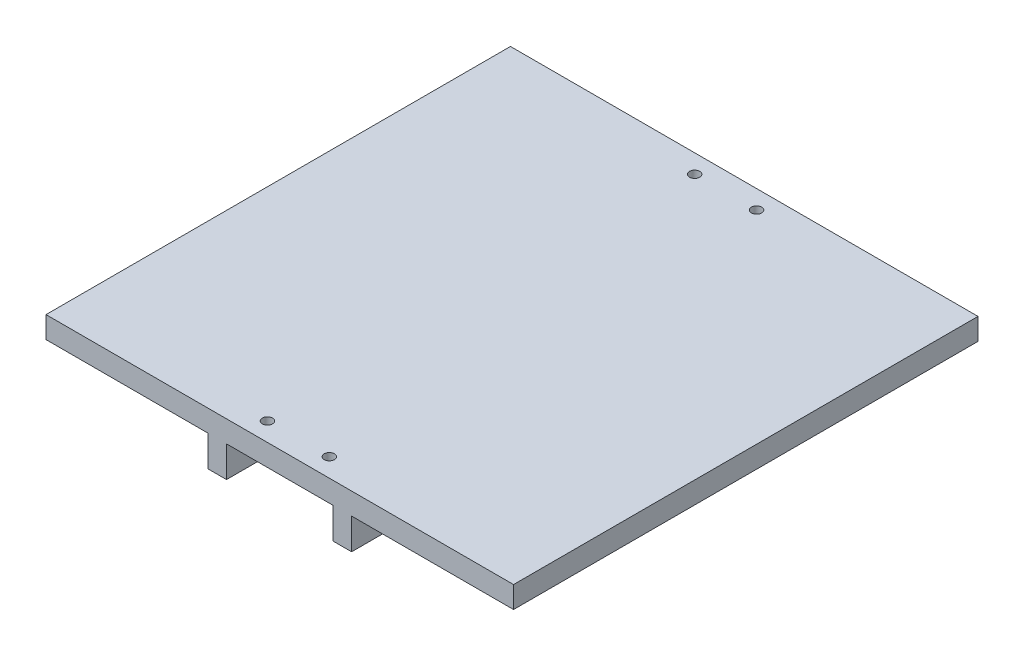
ISO-10303-21;
HEADER;
FILE_DESCRIPTION(('STEP AP214'),'2;1');
FILE_NAME('part.step','',(''),(''),'','','');
FILE_SCHEMA(('AUTOMOTIVE_DESIGN { 1 0 10303 214 1 1 1 1 }'));
ENDSEC;
DATA;
#1=APPLICATION_CONTEXT('core data for automotive mechanical design processes');
#2=APPLICATION_PROTOCOL_DEFINITION('international standard','automotive_design',2000,#1);
#3=PRODUCT_CONTEXT('',#1,'mechanical');
#4=PRODUCT('Part','Part','',(#3));
#5=PRODUCT_RELATED_PRODUCT_CATEGORY('part','',(#4));
#6=PRODUCT_DEFINITION_FORMATION('','',#4);
#7=PRODUCT_DEFINITION_CONTEXT('part definition',#1,'design');
#8=PRODUCT_DEFINITION('design','',#6,#7);
#9=PRODUCT_DEFINITION_SHAPE('','',#8);
#10=(LENGTH_UNIT() NAMED_UNIT(*) SI_UNIT(.MILLI.,.METRE.));
#11=(NAMED_UNIT(*) PLANE_ANGLE_UNIT() SI_UNIT($,.RADIAN.));
#12=(NAMED_UNIT(*) SI_UNIT($,.STERADIAN.) SOLID_ANGLE_UNIT());
#13=UNCERTAINTY_MEASURE_WITH_UNIT(LENGTH_MEASURE(1.E-05),#10,'distance_accuracy_value','');
#14=(GEOMETRIC_REPRESENTATION_CONTEXT(3) GLOBAL_UNCERTAINTY_ASSIGNED_CONTEXT((#13)) GLOBAL_UNIT_ASSIGNED_CONTEXT((#10,
#11,#12)) REPRESENTATION_CONTEXT('',''));
#15=CARTESIAN_POINT('',(0.,0.,0.));
#16=DIRECTION('',(0.,0.,1.));
#17=DIRECTION('',(1.,0.,0.));
#18=AXIS2_PLACEMENT_3D('',#15,#16,#17);
#19=CARTESIAN_POINT('',(23.2,-3.49999999999996,150.));
#20=DIRECTION('',(0.,1.,0.));
#21=DIRECTION('',(-1.,0.,0.));
#22=AXIS2_PLACEMENT_3D('',#19,#20,#21);
#23=PLANE('',#22);
#24=DIRECTION('',(1.,0.,0.));
#25=VECTOR('',#24,1.);
#26=CARTESIAN_POINT('',(23.2,-3.49999999999996,0.));
#27=LINE('',#26,#25);
#28=CARTESIAN_POINT('',(23.2,-3.49999999999996,0.));
#29=VERTEX_POINT('',#28);
#30=CARTESIAN_POINT('',(75.5,-3.5,0.));
#31=VERTEX_POINT('',#30);
#32=EDGE_CURVE('E163',#29,#31,#27,.T.);
#33=ORIENTED_EDGE('',*,*,#32,.T.);
#34=DIRECTION('',(0.,0.,-1.));
#35=VECTOR('',#34,1.);
#36=CARTESIAN_POINT('',(75.5,-3.5,150.));
#37=LINE('',#36,#35);
#38=CARTESIAN_POINT('',(75.5,-3.5,150.));
#39=VERTEX_POINT('',#38);
#40=EDGE_CURVE('E11',#39,#31,#37,.T.);
#41=ORIENTED_EDGE('',*,*,#40,.F.);
#42=DIRECTION('',(1.,0.,0.));
#43=VECTOR('',#42,1.);
#44=CARTESIAN_POINT('',(23.2,-3.49999999999996,150.));
#45=LINE('',#44,#43);
#46=CARTESIAN_POINT('',(23.2,-3.49999999999996,150.));
#47=VERTEX_POINT('',#46);
#48=EDGE_CURVE('E198',#47,#39,#45,.T.);
#49=ORIENTED_EDGE('',*,*,#48,.F.);
#50=DIRECTION('',(0.,0.,-1.));
#51=VECTOR('',#50,1.);
#52=CARTESIAN_POINT('',(23.2,-3.49999999999996,150.));
#53=LINE('',#52,#51);
#54=EDGE_CURVE('E159',#47,#29,#53,.T.);
#55=ORIENTED_EDGE('',*,*,#54,.T.);
#56=EDGE_LOOP('',(#33,#41,#49,#55));
#57=FACE_BOUND('',#56,.T.);
#58=ADVANCED_FACE('F38',(#57),#23,.F.);
#59=CARTESIAN_POINT('',(75.5,3.5,150.));
#60=DIRECTION('',(-1.,0.,0.));
#61=DIRECTION('',(0.,0.,1.));
#62=AXIS2_PLACEMENT_3D('',#59,#60,#61);
#63=PLANE('',#62);
#64=DIRECTION('',(0.,1.,0.));
#65=VECTOR('',#64,1.);
#66=CARTESIAN_POINT('',(75.5,3.5,0.));
#67=LINE('',#66,#65);
#68=CARTESIAN_POINT('',(75.5,3.5,0.));
#69=VERTEX_POINT('',#68);
#70=EDGE_CURVE('E167',#31,#69,#67,.T.);
#71=ORIENTED_EDGE('',*,*,#70,.T.);
#72=DIRECTION('',(0.,0.,-1.));
#73=VECTOR('',#72,1.);
#74=CARTESIAN_POINT('',(75.5,3.5,150.));
#75=LINE('',#74,#73);
#76=CARTESIAN_POINT('',(75.5,3.5,150.));
#77=VERTEX_POINT('',#76);
#78=EDGE_CURVE('E47',#77,#69,#75,.T.);
#79=ORIENTED_EDGE('',*,*,#78,.F.);
#80=DIRECTION('',(0.,1.,0.));
#81=VECTOR('',#80,1.);
#82=CARTESIAN_POINT('',(75.5,3.5,150.));
#83=LINE('',#82,#81);
#84=EDGE_CURVE('E110',#39,#77,#83,.T.);
#85=ORIENTED_EDGE('',*,*,#84,.F.);
#86=ORIENTED_EDGE('',*,*,#40,.T.);
#87=EDGE_LOOP('',(#71,#79,#85,#86));
#88=FACE_BOUND('',#87,.T.);
#89=ADVANCED_FACE('F292',(#88),#63,.F.);
#90=CARTESIAN_POINT('',(-75.5,3.5,150.));
#91=DIRECTION('',(0.,-1.,0.));
#92=DIRECTION('',(0.,0.,-1.));
#93=AXIS2_PLACEMENT_3D('',#90,#91,#92);
#94=PLANE('',#93);
#95=CARTESIAN_POINT('',(9.99999999999998,3.5,6.));
#96=DIRECTION('',(0.,-1.,0.));
#97=DIRECTION('',(0.,0.,-1.));
#98=AXIS2_PLACEMENT_3D('',#95,#96,#97);
#99=CIRCLE('',#98,1.65);
#100=CARTESIAN_POINT('',(9.99999999999998,3.5,4.35));
#101=VERTEX_POINT('',#100);
#102=EDGE_CURVE('E399',#101,#101,#99,.F.);
#103=ORIENTED_EDGE('',*,*,#102,.F.);
#104=EDGE_LOOP('',(#103));
#105=FACE_BOUND('',#104,.T.);
#106=CARTESIAN_POINT('',(-10.,3.5,144.));
#107=DIRECTION('',(0.,-1.,0.));
#108=DIRECTION('',(0.,0.,-1.));
#109=AXIS2_PLACEMENT_3D('',#106,#107,#108);
#110=CIRCLE('',#109,1.65);
#111=CARTESIAN_POINT('',(-10.,3.5,142.35));
#112=VERTEX_POINT('',#111);
#113=EDGE_CURVE('E404',#112,#112,#110,.F.);
#114=ORIENTED_EDGE('',*,*,#113,.F.);
#115=EDGE_LOOP('',(#114));
#116=FACE_BOUND('',#115,.T.);
#117=CARTESIAN_POINT('',(10.,3.5,144.));
#118=DIRECTION('',(0.,-1.,0.));
#119=DIRECTION('',(0.,0.,-1.));
#120=AXIS2_PLACEMENT_3D('',#117,#118,#119);
#121=CIRCLE('',#120,1.65);
#122=CARTESIAN_POINT('',(10.,3.5,142.35));
#123=VERTEX_POINT('',#122);
#124=EDGE_CURVE('E414',#123,#123,#121,.F.);
#125=ORIENTED_EDGE('',*,*,#124,.F.);
#126=EDGE_LOOP('',(#125));
#127=FACE_BOUND('',#126,.T.);
#128=CARTESIAN_POINT('',(-9.99999999999998,3.5,6.));
#129=DIRECTION('',(0.,-1.,0.));
#130=DIRECTION('',(0.,0.,-1.));
#131=AXIS2_PLACEMENT_3D('',#128,#129,#130);
#132=CIRCLE('',#131,1.65);
#133=CARTESIAN_POINT('',(-9.99999999999998,3.5,4.35));
#134=VERTEX_POINT('',#133);
#135=EDGE_CURVE('E168',#134,#134,#132,.F.);
#136=ORIENTED_EDGE('',*,*,#135,.F.);
#137=EDGE_LOOP('',(#136));
#138=FACE_BOUND('',#137,.T.);
#139=DIRECTION('',(-1.,0.,0.));
#140=VECTOR('',#139,1.);
#141=CARTESIAN_POINT('',(-75.5,3.5,0.));
#142=LINE('',#141,#140);
#143=CARTESIAN_POINT('',(-75.5,3.5,0.));
#144=VERTEX_POINT('',#143);
#145=EDGE_CURVE('E171',#69,#144,#142,.T.);
#146=ORIENTED_EDGE('',*,*,#145,.T.);
#147=DIRECTION('',(0.,0.,-1.));
#148=VECTOR('',#147,1.);
#149=CARTESIAN_POINT('',(-75.5,3.5,150.));
#150=LINE('',#149,#148);
#151=CARTESIAN_POINT('',(-75.5,3.5,150.));
#152=VERTEX_POINT('',#151);
#153=EDGE_CURVE('E225',#152,#144,#150,.T.);
#154=ORIENTED_EDGE('',*,*,#153,.F.);
#155=DIRECTION('',(-1.,0.,0.));
#156=VECTOR('',#155,1.);
#157=CARTESIAN_POINT('',(-75.5,3.5,150.));
#158=LINE('',#157,#156);
#159=EDGE_CURVE('E235',#77,#152,#158,.T.);
#160=ORIENTED_EDGE('',*,*,#159,.F.);
#161=ORIENTED_EDGE('',*,*,#78,.T.);
#162=EDGE_LOOP('',(#146,#154,#160,#161));
#163=FACE_BOUND('',#162,.T.);
#164=ADVANCED_FACE('F233',(#105,#116,#127,#138,#163),#94,.F.);
#165=CARTESIAN_POINT('',(-75.5,3.5,150.));
#166=DIRECTION('',(1.,0.,0.));
#167=DIRECTION('',(0.,0.,-1.));
#168=AXIS2_PLACEMENT_3D('',#165,#166,#167);
#169=PLANE('',#168);
#170=DIRECTION('',(0.,-1.,0.));
#171=VECTOR('',#170,1.);
#172=CARTESIAN_POINT('',(-75.5,3.5,0.));
#173=LINE('',#172,#171);
#174=CARTESIAN_POINT('',(-75.5,-3.5,0.));
#175=VERTEX_POINT('',#174);
#176=EDGE_CURVE('E174',#144,#175,#173,.T.);
#177=ORIENTED_EDGE('',*,*,#176,.T.);
#178=DIRECTION('',(0.,0.,-1.));
#179=VECTOR('',#178,1.);
#180=CARTESIAN_POINT('',(-75.5,-3.5,150.));
#181=LINE('',#180,#179);
#182=CARTESIAN_POINT('',(-75.5,-3.5,150.));
#183=VERTEX_POINT('',#182);
#184=EDGE_CURVE('E221',#183,#175,#181,.T.);
#185=ORIENTED_EDGE('',*,*,#184,.F.);
#186=DIRECTION('',(0.,-1.,0.));
#187=VECTOR('',#186,1.);
#188=CARTESIAN_POINT('',(-75.5,3.5,150.));
#189=LINE('',#188,#187);
#190=EDGE_CURVE('E254',#152,#183,#189,.T.);
#191=ORIENTED_EDGE('',*,*,#190,.F.);
#192=ORIENTED_EDGE('',*,*,#153,.T.);
#193=EDGE_LOOP('',(#177,#185,#191,#192));
#194=FACE_BOUND('',#193,.T.);
#195=ADVANCED_FACE('F244',(#194),#169,.F.);
#196=CARTESIAN_POINT('',(-75.5,-3.5,150.));
#197=DIRECTION('',(0.,1.,0.));
#198=DIRECTION('',(-1.,0.,0.));
#199=AXIS2_PLACEMENT_3D('',#196,#197,#198);
#200=PLANE('',#199);
#201=DIRECTION('',(1.,0.,0.));
#202=VECTOR('',#201,1.);
#203=CARTESIAN_POINT('',(-75.5,-3.5,0.));
#204=LINE('',#203,#202);
#205=CARTESIAN_POINT('',(-23.2,-3.49999999999996,0.));
#206=VERTEX_POINT('',#205);
#207=EDGE_CURVE('E177',#175,#206,#204,.T.);
#208=ORIENTED_EDGE('',*,*,#207,.T.);
#209=DIRECTION('',(0.,0.,-1.));
#210=VECTOR('',#209,1.);
#211=CARTESIAN_POINT('',(-23.2,-3.49999999999996,150.));
#212=LINE('',#211,#210);
#213=CARTESIAN_POINT('',(-23.2,-3.49999999999996,150.));
#214=VERTEX_POINT('',#213);
#215=EDGE_CURVE('E217',#214,#206,#212,.T.);
#216=ORIENTED_EDGE('',*,*,#215,.F.);
#217=DIRECTION('',(1.,0.,0.));
#218=VECTOR('',#217,1.);
#219=CARTESIAN_POINT('',(-75.5,-3.5,150.));
#220=LINE('',#219,#218);
#221=EDGE_CURVE('E250',#183,#214,#220,.T.);
#222=ORIENTED_EDGE('',*,*,#221,.F.);
#223=ORIENTED_EDGE('',*,*,#184,.T.);
#224=EDGE_LOOP('',(#208,#216,#222,#223));
#225=FACE_BOUND('',#224,.T.);
#226=ADVANCED_FACE('F248',(#225),#200,.F.);
#227=CARTESIAN_POINT('',(-23.2,-13.5,150.));
#228=DIRECTION('',(1.,0.,0.));
#229=DIRECTION('',(0.,1.,0.));
#230=AXIS2_PLACEMENT_3D('',#227,#228,#229);
#231=PLANE('',#230);
#232=DIRECTION('',(0.,-1.,0.));
#233=VECTOR('',#232,1.);
#234=CARTESIAN_POINT('',(-23.2,-13.5,0.));
#235=LINE('',#234,#233);
#236=CARTESIAN_POINT('',(-23.2,-13.5,0.));
#237=VERTEX_POINT('',#236);
#238=EDGE_CURVE('E180',#206,#237,#235,.T.);
#239=ORIENTED_EDGE('',*,*,#238,.T.);
#240=DIRECTION('',(0.,0.,-1.));
#241=VECTOR('',#240,1.);
#242=CARTESIAN_POINT('',(-23.2,-13.5,150.));
#243=LINE('',#242,#241);
#244=CARTESIAN_POINT('',(-23.2,-13.5,150.));
#245=VERTEX_POINT('',#244);
#246=EDGE_CURVE('E213',#245,#237,#243,.T.);
#247=ORIENTED_EDGE('',*,*,#246,.F.);
#248=DIRECTION('',(0.,-1.,0.));
#249=VECTOR('',#248,1.);
#250=CARTESIAN_POINT('',(-23.2,-13.5,150.));
#251=LINE('',#250,#249);
#252=EDGE_CURVE('E253',#214,#245,#251,.T.);
#253=ORIENTED_EDGE('',*,*,#252,.F.);
#254=ORIENTED_EDGE('',*,*,#215,.T.);
#255=EDGE_LOOP('',(#239,#247,#253,#254));
#256=FACE_BOUND('',#255,.T.);
#257=ADVANCED_FACE('F307',(#256),#231,.F.);
#258=CARTESIAN_POINT('',(-17.2,-13.5,150.));
#259=DIRECTION('',(0.,1.,0.));
#260=DIRECTION('',(-1.,0.,0.));
#261=AXIS2_PLACEMENT_3D('',#258,#259,#260);
#262=PLANE('',#261);
#263=DIRECTION('',(1.,0.,0.));
#264=VECTOR('',#263,1.);
#265=CARTESIAN_POINT('',(-17.2,-13.5,0.));
#266=LINE('',#265,#264);
#267=CARTESIAN_POINT('',(-17.2,-13.5,0.));
#268=VERTEX_POINT('',#267);
#269=EDGE_CURVE('E183',#237,#268,#266,.T.);
#270=ORIENTED_EDGE('',*,*,#269,.T.);
#271=DIRECTION('',(0.,0.,-1.));
#272=VECTOR('',#271,1.);
#273=CARTESIAN_POINT('',(-17.2,-13.5,150.));
#274=LINE('',#273,#272);
#275=CARTESIAN_POINT('',(-17.2,-13.5,150.));
#276=VERTEX_POINT('',#275);
#277=EDGE_CURVE('E209',#276,#268,#274,.T.);
#278=ORIENTED_EDGE('',*,*,#277,.F.);
#279=DIRECTION('',(1.,0.,0.));
#280=VECTOR('',#279,1.);
#281=CARTESIAN_POINT('',(-17.2,-13.5,150.));
#282=LINE('',#281,#280);
#283=EDGE_CURVE('E258',#245,#276,#282,.T.);
#284=ORIENTED_EDGE('',*,*,#283,.F.);
#285=ORIENTED_EDGE('',*,*,#246,.T.);
#286=EDGE_LOOP('',(#270,#278,#284,#285));
#287=FACE_BOUND('',#286,.T.);
#288=ADVANCED_FACE('F310',(#287),#262,.F.);
#289=CARTESIAN_POINT('',(-17.2,-3.49999999999996,150.));
#290=DIRECTION('',(-1.,0.,0.));
#291=DIRECTION('',(0.,-1.,0.));
#292=AXIS2_PLACEMENT_3D('',#289,#290,#291);
#293=PLANE('',#292);
#294=DIRECTION('',(0.,1.,0.));
#295=VECTOR('',#294,1.);
#296=CARTESIAN_POINT('',(-17.2,-3.49999999999996,0.));
#297=LINE('',#296,#295);
#298=CARTESIAN_POINT('',(-17.2,-3.49999999999996,0.));
#299=VERTEX_POINT('',#298);
#300=EDGE_CURVE('E186',#268,#299,#297,.T.);
#301=ORIENTED_EDGE('',*,*,#300,.T.);
#302=DIRECTION('',(0.,0.,-1.));
#303=VECTOR('',#302,1.);
#304=CARTESIAN_POINT('',(-17.2,-3.49999999999996,150.));
#305=LINE('',#304,#303);
#306=CARTESIAN_POINT('',(-17.2,-3.49999999999996,150.));
#307=VERTEX_POINT('',#306);
#308=EDGE_CURVE('E205',#307,#299,#305,.T.);
#309=ORIENTED_EDGE('',*,*,#308,.F.);
#310=DIRECTION('',(0.,1.,0.));
#311=VECTOR('',#310,1.);
#312=CARTESIAN_POINT('',(-17.2,-3.49999999999996,150.));
#313=LINE('',#312,#311);
#314=EDGE_CURVE('E265',#276,#307,#313,.T.);
#315=ORIENTED_EDGE('',*,*,#314,.F.);
#316=ORIENTED_EDGE('',*,*,#277,.T.);
#317=EDGE_LOOP('',(#301,#309,#315,#316));
#318=FACE_BOUND('',#317,.T.);
#319=ADVANCED_FACE('F273',(#318),#293,.F.);
#320=CARTESIAN_POINT('',(-17.2,-3.49999999999996,150.));
#321=DIRECTION('',(0.,1.,0.));
#322=DIRECTION('',(0.,0.,1.));
#323=AXIS2_PLACEMENT_3D('',#320,#321,#322);
#324=PLANE('',#323);
#325=CARTESIAN_POINT('',(9.99999999999998,-3.49999999999996,6.));
#326=DIRECTION('',(0.,-1.,0.));
#327=DIRECTION('',(0.,0.,1.));
#328=AXIS2_PLACEMENT_3D('',#325,#326,#327);
#329=CIRCLE('',#328,1.65);
#330=CARTESIAN_POINT('',(9.99999999999998,-3.49999999999996,7.65));
#331=VERTEX_POINT('',#330);
#332=EDGE_CURVE('E402',#331,#331,#329,.T.);
#333=ORIENTED_EDGE('',*,*,#332,.F.);
#334=EDGE_LOOP('',(#333));
#335=FACE_BOUND('',#334,.T.);
#336=CARTESIAN_POINT('',(-10.,-3.49999999999996,144.));
#337=DIRECTION('',(0.,-1.,0.));
#338=DIRECTION('',(0.,0.,-1.));
#339=AXIS2_PLACEMENT_3D('',#336,#337,#338);
#340=CIRCLE('',#339,1.65);
#341=CARTESIAN_POINT('',(-10.,-3.49999999999996,142.35));
#342=VERTEX_POINT('',#341);
#343=EDGE_CURVE('E411',#342,#342,#340,.T.);
#344=ORIENTED_EDGE('',*,*,#343,.F.);
#345=EDGE_LOOP('',(#344));
#346=FACE_BOUND('',#345,.T.);
#347=CARTESIAN_POINT('',(10.,-3.49999999999996,144.));
#348=DIRECTION('',(0.,-1.,0.));
#349=DIRECTION('',(0.,0.,1.));
#350=AXIS2_PLACEMENT_3D('',#347,#348,#349);
#351=CIRCLE('',#350,1.65);
#352=CARTESIAN_POINT('',(10.,-3.49999999999996,145.65));
#353=VERTEX_POINT('',#352);
#354=EDGE_CURVE('E439',#353,#353,#351,.T.);
#355=ORIENTED_EDGE('',*,*,#354,.F.);
#356=EDGE_LOOP('',(#355));
#357=FACE_BOUND('',#356,.T.);
#358=CARTESIAN_POINT('',(-9.99999999999998,-3.49999999999996,6.));
#359=DIRECTION('',(0.,-1.,0.));
#360=DIRECTION('',(0.,0.,-1.));
#361=AXIS2_PLACEMENT_3D('',#358,#359,#360);
#362=CIRCLE('',#361,1.65);
#363=CARTESIAN_POINT('',(-9.99999999999998,-3.49999999999996,4.35));
#364=VERTEX_POINT('',#363);
#365=EDGE_CURVE('E408',#364,#364,#362,.T.);
#366=ORIENTED_EDGE('',*,*,#365,.F.);
#367=EDGE_LOOP('',(#366));
#368=FACE_BOUND('',#367,.T.);
#369=DIRECTION('',(1.,0.,0.));
#370=VECTOR('',#369,1.);
#371=CARTESIAN_POINT('',(-17.2,-3.49999999999996,0.));
#372=LINE('',#371,#370);
#373=CARTESIAN_POINT('',(17.2,-3.49999999999996,0.));
#374=VERTEX_POINT('',#373);
#375=EDGE_CURVE('E189',#299,#374,#372,.T.);
#376=ORIENTED_EDGE('',*,*,#375,.T.);
#377=DIRECTION('',(0.,0.,-1.));
#378=VECTOR('',#377,1.);
#379=CARTESIAN_POINT('',(17.2,-3.49999999999996,150.));
#380=LINE('',#379,#378);
#381=CARTESIAN_POINT('',(17.2,-3.49999999999996,150.));
#382=VERTEX_POINT('',#381);
#383=EDGE_CURVE('E152',#382,#374,#380,.T.);
#384=ORIENTED_EDGE('',*,*,#383,.F.);
#385=DIRECTION('',(1.,0.,0.));
#386=VECTOR('',#385,1.);
#387=CARTESIAN_POINT('',(-17.2,-3.49999999999996,150.));
#388=LINE('',#387,#386);
#389=EDGE_CURVE('E141',#307,#382,#388,.T.);
#390=ORIENTED_EDGE('',*,*,#389,.F.);
#391=ORIENTED_EDGE('',*,*,#308,.T.);
#392=EDGE_LOOP('',(#376,#384,#390,#391));
#393=FACE_BOUND('',#392,.T.);
#394=ADVANCED_FACE('F277',(#335,#346,#357,#368,#393),#324,.F.);
#395=CARTESIAN_POINT('',(17.2,-3.49999999999996,150.));
#396=DIRECTION('',(1.,0.,0.));
#397=DIRECTION('',(0.,0.,-1.));
#398=AXIS2_PLACEMENT_3D('',#395,#396,#397);
#399=PLANE('',#398);
#400=DIRECTION('',(0.,-1.,0.));
#401=VECTOR('',#400,1.);
#402=CARTESIAN_POINT('',(17.2,-3.49999999999996,0.));
#403=LINE('',#402,#401);
#404=CARTESIAN_POINT('',(17.2,-13.5,0.));
#405=VERTEX_POINT('',#404);
#406=EDGE_CURVE('E150',#374,#405,#403,.T.);
#407=ORIENTED_EDGE('',*,*,#406,.T.);
#408=DIRECTION('',(0.,0.,-1.));
#409=VECTOR('',#408,1.);
#410=CARTESIAN_POINT('',(17.2,-13.5,150.));
#411=LINE('',#410,#409);
#412=CARTESIAN_POINT('',(17.2,-13.5,150.));
#413=VERTEX_POINT('',#412);
#414=EDGE_CURVE('E147',#413,#405,#411,.T.);
#415=ORIENTED_EDGE('',*,*,#414,.F.);
#416=DIRECTION('',(0.,-1.,0.));
#417=VECTOR('',#416,1.);
#418=CARTESIAN_POINT('',(17.2,-3.49999999999996,150.));
#419=LINE('',#418,#417);
#420=EDGE_CURVE('E135',#382,#413,#419,.T.);
#421=ORIENTED_EDGE('',*,*,#420,.F.);
#422=ORIENTED_EDGE('',*,*,#383,.T.);
#423=EDGE_LOOP('',(#407,#415,#421,#422));
#424=FACE_BOUND('',#423,.T.);
#425=ADVANCED_FACE('F148',(#424),#399,.F.);
#426=CARTESIAN_POINT('',(17.2,-13.5,150.));
#427=DIRECTION('',(0.,1.,0.));
#428=DIRECTION('',(0.,0.,1.));
#429=AXIS2_PLACEMENT_3D('',#426,#427,#428);
#430=PLANE('',#429);
#431=DIRECTION('',(1.,0.,0.));
#432=VECTOR('',#431,1.);
#433=CARTESIAN_POINT('',(17.2,-13.5,0.));
#434=LINE('',#433,#432);
#435=CARTESIAN_POINT('',(23.2,-13.5,0.));
#436=VERTEX_POINT('',#435);
#437=EDGE_CURVE('E96',#405,#436,#434,.T.);
#438=ORIENTED_EDGE('',*,*,#437,.T.);
#439=DIRECTION('',(0.,0.,-1.));
#440=VECTOR('',#439,1.);
#441=CARTESIAN_POINT('',(23.2,-13.5,150.));
#442=LINE('',#441,#440);
#443=CARTESIAN_POINT('',(23.2,-13.5,150.));
#444=VERTEX_POINT('',#443);
#445=EDGE_CURVE('E153',#444,#436,#442,.T.);
#446=ORIENTED_EDGE('',*,*,#445,.F.);
#447=DIRECTION('',(1.,0.,0.));
#448=VECTOR('',#447,1.);
#449=CARTESIAN_POINT('',(17.2,-13.5,150.));
#450=LINE('',#449,#448);
#451=EDGE_CURVE('E139',#413,#444,#450,.T.);
#452=ORIENTED_EDGE('',*,*,#451,.F.);
#453=ORIENTED_EDGE('',*,*,#414,.T.);
#454=EDGE_LOOP('',(#438,#446,#452,#453));
#455=FACE_BOUND('',#454,.T.);
#456=ADVANCED_FACE('F155',(#455),#430,.F.);
#457=CARTESIAN_POINT('',(23.2,-13.5,150.));
#458=DIRECTION('',(-1.,0.,0.));
#459=DIRECTION('',(0.,0.,1.));
#460=AXIS2_PLACEMENT_3D('',#457,#458,#459);
#461=PLANE('',#460);
#462=DIRECTION('',(0.,1.,0.));
#463=VECTOR('',#462,1.);
#464=CARTESIAN_POINT('',(23.2,-13.5,0.));
#465=LINE('',#464,#463);
#466=EDGE_CURVE('E102',#436,#29,#465,.T.);
#467=ORIENTED_EDGE('',*,*,#466,.T.);
#468=ORIENTED_EDGE('',*,*,#54,.F.);
#469=DIRECTION('',(0.,1.,0.));
#470=VECTOR('',#469,1.);
#471=CARTESIAN_POINT('',(23.2,-13.5,150.));
#472=LINE('',#471,#470);
#473=EDGE_CURVE('E55',#444,#47,#472,.T.);
#474=ORIENTED_EDGE('',*,*,#473,.F.);
#475=ORIENTED_EDGE('',*,*,#445,.T.);
#476=EDGE_LOOP('',(#467,#468,#474,#475));
#477=FACE_BOUND('',#476,.T.);
#478=ADVANCED_FACE('F281',(#477),#461,.F.);
#479=CARTESIAN_POINT('',(0.,0.,150.));
#480=DIRECTION('',(0.,0.,-1.));
#481=DIRECTION('',(-1.,0.,0.));
#482=AXIS2_PLACEMENT_3D('',#479,#480,#481);
#483=PLANE('',#482);
#484=ORIENTED_EDGE('',*,*,#48,.T.);
#485=ORIENTED_EDGE('',*,*,#84,.T.);
#486=ORIENTED_EDGE('',*,*,#159,.T.);
#487=ORIENTED_EDGE('',*,*,#190,.T.);
#488=ORIENTED_EDGE('',*,*,#221,.T.);
#489=ORIENTED_EDGE('',*,*,#252,.T.);
#490=ORIENTED_EDGE('',*,*,#283,.T.);
#491=ORIENTED_EDGE('',*,*,#314,.T.);
#492=ORIENTED_EDGE('',*,*,#389,.T.);
#493=ORIENTED_EDGE('',*,*,#420,.T.);
#494=ORIENTED_EDGE('',*,*,#451,.T.);
#495=ORIENTED_EDGE('',*,*,#473,.T.);
#496=EDGE_LOOP('',(#484,#485,#486,#487,#488,#489,#490,#491,#492,#493,#494,#495));
#497=FACE_BOUND('',#496,.T.);
#498=ADVANCED_FACE('F137',(#497),#483,.F.);
#499=CARTESIAN_POINT('',(0.,0.,0.));
#500=DIRECTION('',(0.,0.,-1.));
#501=DIRECTION('',(-1.,0.,0.));
#502=AXIS2_PLACEMENT_3D('',#499,#500,#501);
#503=PLANE('',#502);
#504=ORIENTED_EDGE('',*,*,#32,.F.);
#505=ORIENTED_EDGE('',*,*,#466,.F.);
#506=ORIENTED_EDGE('',*,*,#437,.F.);
#507=ORIENTED_EDGE('',*,*,#406,.F.);
#508=ORIENTED_EDGE('',*,*,#375,.F.);
#509=ORIENTED_EDGE('',*,*,#300,.F.);
#510=ORIENTED_EDGE('',*,*,#269,.F.);
#511=ORIENTED_EDGE('',*,*,#238,.F.);
#512=ORIENTED_EDGE('',*,*,#207,.F.);
#513=ORIENTED_EDGE('',*,*,#176,.F.);
#514=ORIENTED_EDGE('',*,*,#145,.F.);
#515=ORIENTED_EDGE('',*,*,#70,.F.);
#516=EDGE_LOOP('',(#504,#505,#506,#507,#508,#509,#510,#511,#512,#513,#514,#515));
#517=FACE_BOUND('',#516,.T.);
#518=ADVANCED_FACE('F239',(#517),#503,.T.);
#519=CARTESIAN_POINT('',(-9.99999999999998,8.16690475583124,6.));
#520=DIRECTION('',(0.,-1.,0.));
#521=DIRECTION('',(0.,0.,-1.));
#522=AXIS2_PLACEMENT_3D('',#519,#520,#521);
#523=CYLINDRICAL_SURFACE('',#522,1.65);
#524=ORIENTED_EDGE('',*,*,#135,.T.);
#525=EDGE_LOOP('',(#524));
#526=FACE_BOUND('',#525,.T.);
#527=ORIENTED_EDGE('',*,*,#365,.T.);
#528=EDGE_LOOP('',(#527));
#529=FACE_BOUND('',#528,.T.);
#530=ADVANCED_FACE('F349',(#526,#529),#523,.F.);
#531=CARTESIAN_POINT('',(10.,8.16690475583124,144.));
#532=DIRECTION('',(0.,-1.,0.));
#533=DIRECTION('',(0.,0.,-1.));
#534=AXIS2_PLACEMENT_3D('',#531,#532,#533);
#535=CYLINDRICAL_SURFACE('',#534,1.65);
#536=ORIENTED_EDGE('',*,*,#124,.T.);
#537=EDGE_LOOP('',(#536));
#538=FACE_BOUND('',#537,.T.);
#539=ORIENTED_EDGE('',*,*,#354,.T.);
#540=EDGE_LOOP('',(#539));
#541=FACE_BOUND('',#540,.T.);
#542=ADVANCED_FACE('F362',(#538,#541),#535,.F.);
#543=CARTESIAN_POINT('',(-10.,8.16690475583124,144.));
#544=DIRECTION('',(0.,-1.,0.));
#545=DIRECTION('',(0.,0.,-1.));
#546=AXIS2_PLACEMENT_3D('',#543,#544,#545);
#547=CYLINDRICAL_SURFACE('',#546,1.65);
#548=ORIENTED_EDGE('',*,*,#113,.T.);
#549=EDGE_LOOP('',(#548));
#550=FACE_BOUND('',#549,.T.);
#551=ORIENTED_EDGE('',*,*,#343,.T.);
#552=EDGE_LOOP('',(#551));
#553=FACE_BOUND('',#552,.T.);
#554=ADVANCED_FACE('F372',(#550,#553),#547,.F.);
#555=CARTESIAN_POINT('',(9.99999999999998,8.16690475583124,6.));
#556=DIRECTION('',(0.,-1.,0.));
#557=DIRECTION('',(0.,0.,-1.));
#558=AXIS2_PLACEMENT_3D('',#555,#556,#557);
#559=CYLINDRICAL_SURFACE('',#558,1.65);
#560=ORIENTED_EDGE('',*,*,#102,.T.);
#561=EDGE_LOOP('',(#560));
#562=FACE_BOUND('',#561,.T.);
#563=ORIENTED_EDGE('',*,*,#332,.T.);
#564=EDGE_LOOP('',(#563));
#565=FACE_BOUND('',#564,.T.);
#566=ADVANCED_FACE('F382',(#562,#565),#559,.F.);
#567=CLOSED_SHELL('',(#58,#89,#164,#195,#226,#257,#288,#319,#394,#425,#456,#478,#498,#518,#530,
#542,#554,#566));
#568=MANIFOLD_SOLID_BREP('B2',#567);
#569=ADVANCED_BREP_SHAPE_REPRESENTATION('',(#18,#568),#14);
#570=SHAPE_DEFINITION_REPRESENTATION(#9,#569);
ENDSEC;
END-ISO-10303-21;
